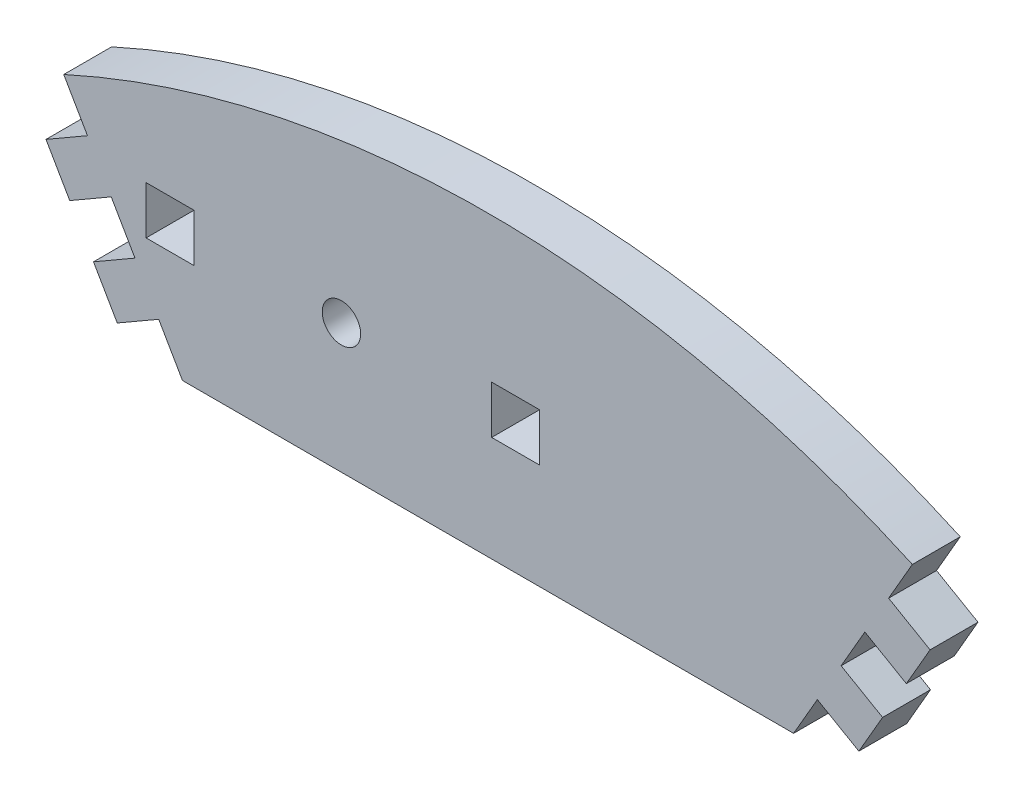
ISO-10303-21;
HEADER;
FILE_DESCRIPTION(('STEP AP214'),'2;1');
FILE_NAME('part.step','',(''),(''),'','','');
FILE_SCHEMA(('AUTOMOTIVE_DESIGN { 1 0 10303 214 1 1 1 1 }'));
ENDSEC;
DATA;
#1=APPLICATION_CONTEXT('core data for automotive mechanical design processes');
#2=APPLICATION_PROTOCOL_DEFINITION('international standard','automotive_design',2000,#1);
#3=PRODUCT_CONTEXT('',#1,'mechanical');
#4=PRODUCT('Part','Part','',(#3));
#5=PRODUCT_RELATED_PRODUCT_CATEGORY('part','',(#4));
#6=PRODUCT_DEFINITION_FORMATION('','',#4);
#7=PRODUCT_DEFINITION_CONTEXT('part definition',#1,'design');
#8=PRODUCT_DEFINITION('design','',#6,#7);
#9=PRODUCT_DEFINITION_SHAPE('','',#8);
#10=(LENGTH_UNIT() NAMED_UNIT(*) SI_UNIT(.MILLI.,.METRE.));
#11=(NAMED_UNIT(*) PLANE_ANGLE_UNIT() SI_UNIT($,.RADIAN.));
#12=(NAMED_UNIT(*) SI_UNIT($,.STERADIAN.) SOLID_ANGLE_UNIT());
#13=UNCERTAINTY_MEASURE_WITH_UNIT(LENGTH_MEASURE(1.E-05),#10,'distance_accuracy_value','');
#14=(GEOMETRIC_REPRESENTATION_CONTEXT(3) GLOBAL_UNCERTAINTY_ASSIGNED_CONTEXT((#13)) GLOBAL_UNIT_ASSIGNED_CONTEXT((#10,
#11,#12)) REPRESENTATION_CONTEXT('',''));
#15=CARTESIAN_POINT('',(0.,0.,0.));
#16=DIRECTION('',(0.,0.,1.));
#17=DIRECTION('',(1.,0.,0.));
#18=AXIS2_PLACEMENT_3D('',#15,#16,#17);
#19=CARTESIAN_POINT('',(-35.403,82.4086096476236,5.15));
#20=DIRECTION('',(-0.5,0.866025403784439,0.));
#21=DIRECTION('',(-0.866025403784439,-0.5,0.));
#22=AXIS2_PLACEMENT_3D('',#19,#20,#21);
#23=PLANE('',#22);
#24=DIRECTION('',(0.866025403784439,0.5,0.));
#25=VECTOR('',#24,1.);
#26=CARTESIAN_POINT('',(-35.403,82.4086096476236,0.));
#27=LINE('',#26,#25);
#28=CARTESIAN_POINT('',(-39.8630308294899,79.8336096476236,0.));
#29=VERTEX_POINT('',#28);
#30=CARTESIAN_POINT('',(-35.403,82.4086096476236,0.));
#31=VERTEX_POINT('',#30);
#32=EDGE_CURVE('E283',#29,#31,#27,.T.);
#33=ORIENTED_EDGE('',*,*,#32,.T.);
#34=DIRECTION('',(0.,0.,-1.));
#35=VECTOR('',#34,1.);
#36=CARTESIAN_POINT('',(-35.403,82.4086096476236,5.15));
#37=LINE('',#36,#35);
#38=CARTESIAN_POINT('',(-35.403,82.4086096476236,5.15));
#39=VERTEX_POINT('',#38);
#40=EDGE_CURVE('E11',#39,#31,#37,.T.);
#41=ORIENTED_EDGE('',*,*,#40,.F.);
#42=DIRECTION('',(0.866025403784439,0.5,0.));
#43=VECTOR('',#42,1.);
#44=CARTESIAN_POINT('',(-35.403,82.4086096476236,5.15));
#45=LINE('',#44,#43);
#46=CARTESIAN_POINT('',(-39.8630308294899,79.8336096476236,5.15));
#47=VERTEX_POINT('',#46);
#48=EDGE_CURVE('E290',#47,#39,#45,.T.);
#49=ORIENTED_EDGE('',*,*,#48,.F.);
#50=DIRECTION('',(0.,0.,-1.));
#51=VECTOR('',#50,1.);
#52=CARTESIAN_POINT('',(-39.8630308294899,79.8336096476236,5.15));
#53=LINE('',#52,#51);
#54=EDGE_CURVE('E332',#47,#29,#53,.T.);
#55=ORIENTED_EDGE('',*,*,#54,.T.);
#56=EDGE_LOOP('',(#33,#41,#49,#55));
#57=FACE_BOUND('',#56,.T.);
#58=ADVANCED_FACE('F33',(#57),#23,.F.);
#59=CARTESIAN_POINT('',(-32.85,77.9866839359003,5.15));
#60=DIRECTION('',(0.866025403784441,0.499999999999996,0.));
#61=DIRECTION('',(-0.499999999999996,0.866025403784441,0.));
#62=AXIS2_PLACEMENT_3D('',#59,#60,#61);
#63=PLANE('',#62);
#64=DIRECTION('',(0.499999999999996,-0.866025403784441,0.));
#65=VECTOR('',#64,1.);
#66=CARTESIAN_POINT('',(-32.85,77.9866839359003,0.));
#67=LINE('',#66,#65);
#68=CARTESIAN_POINT('',(-32.85,77.9866839359003,0.));
#69=VERTEX_POINT('',#68);
#70=EDGE_CURVE('E335',#31,#69,#67,.T.);
#71=ORIENTED_EDGE('',*,*,#70,.T.);
#72=DIRECTION('',(0.,0.,-1.));
#73=VECTOR('',#72,1.);
#74=CARTESIAN_POINT('',(-32.85,77.9866839359003,5.15));
#75=LINE('',#74,#73);
#76=CARTESIAN_POINT('',(-32.85,77.9866839359003,5.15));
#77=VERTEX_POINT('',#76);
#78=EDGE_CURVE('E40',#77,#69,#75,.T.);
#79=ORIENTED_EDGE('',*,*,#78,.F.);
#80=DIRECTION('',(0.499999999999996,-0.866025403784441,0.));
#81=VECTOR('',#80,1.);
#82=CARTESIAN_POINT('',(-32.85,77.9866839359003,5.15));
#83=LINE('',#82,#81);
#84=EDGE_CURVE('E293',#39,#77,#83,.T.);
#85=ORIENTED_EDGE('',*,*,#84,.F.);
#86=ORIENTED_EDGE('',*,*,#40,.T.);
#87=EDGE_LOOP('',(#71,#79,#85,#86));
#88=FACE_BOUND('',#87,.T.);
#89=ADVANCED_FACE('F451',(#88),#63,.F.);
#90=CARTESIAN_POINT('',(-32.85,77.9866839359003,5.15));
#91=DIRECTION('',(0.,1.,0.));
#92=DIRECTION('',(-1.,0.,0.));
#93=AXIS2_PLACEMENT_3D('',#90,#91,#92);
#94=PLANE('',#93);
#95=DIRECTION('',(1.,0.,0.));
#96=VECTOR('',#95,1.);
#97=CARTESIAN_POINT('',(-32.85,77.9866839359003,0.));
#98=LINE('',#97,#96);
#99=CARTESIAN_POINT('',(32.85,77.9866839359003,0.));
#100=VERTEX_POINT('',#99);
#101=EDGE_CURVE('E337',#69,#100,#98,.T.);
#102=ORIENTED_EDGE('',*,*,#101,.T.);
#103=DIRECTION('',(0.,0.,-1.));
#104=VECTOR('',#103,1.);
#105=CARTESIAN_POINT('',(32.85,77.9866839359003,5.15));
#106=LINE('',#105,#104);
#107=CARTESIAN_POINT('',(32.85,77.9866839359003,5.15));
#108=VERTEX_POINT('',#107);
#109=EDGE_CURVE('E422',#108,#100,#106,.T.);
#110=ORIENTED_EDGE('',*,*,#109,.F.);
#111=DIRECTION('',(1.,0.,0.));
#112=VECTOR('',#111,1.);
#113=CARTESIAN_POINT('',(-32.85,77.9866839359003,5.15));
#114=LINE('',#113,#112);
#115=EDGE_CURVE('E296',#77,#108,#114,.T.);
#116=ORIENTED_EDGE('',*,*,#115,.F.);
#117=ORIENTED_EDGE('',*,*,#78,.T.);
#118=EDGE_LOOP('',(#102,#110,#116,#117));
#119=FACE_BOUND('',#118,.T.);
#120=ADVANCED_FACE('F429',(#119),#94,.F.);
#121=CARTESIAN_POINT('',(32.85,77.9866839359003,5.15));
#122=DIRECTION('',(-0.86602540378444,0.499999999999997,0.));
#123=DIRECTION('',(-0.499999999999997,-0.86602540378444,0.));
#124=AXIS2_PLACEMENT_3D('',#121,#122,#123);
#125=PLANE('',#124);
#126=DIRECTION('',(0.499999999999997,0.86602540378444,0.));
#127=VECTOR('',#126,1.);
#128=CARTESIAN_POINT('',(32.85,77.9866839359003,0.));
#129=LINE('',#128,#127);
#130=CARTESIAN_POINT('',(35.403,82.4086096476236,0.));
#131=VERTEX_POINT('',#130);
#132=EDGE_CURVE('E339',#100,#131,#129,.T.);
#133=ORIENTED_EDGE('',*,*,#132,.T.);
#134=DIRECTION('',(0.,0.,-1.));
#135=VECTOR('',#134,1.);
#136=CARTESIAN_POINT('',(35.403,82.4086096476236,5.15));
#137=LINE('',#136,#135);
#138=CARTESIAN_POINT('',(35.403,82.4086096476236,5.15));
#139=VERTEX_POINT('',#138);
#140=EDGE_CURVE('E419',#139,#131,#137,.T.);
#141=ORIENTED_EDGE('',*,*,#140,.F.);
#142=DIRECTION('',(0.499999999999997,0.86602540378444,0.));
#143=VECTOR('',#142,1.);
#144=CARTESIAN_POINT('',(32.85,77.9866839359003,5.15));
#145=LINE('',#144,#143);
#146=EDGE_CURVE('E298',#108,#139,#145,.T.);
#147=ORIENTED_EDGE('',*,*,#146,.F.);
#148=ORIENTED_EDGE('',*,*,#109,.T.);
#149=EDGE_LOOP('',(#133,#141,#147,#148));
#150=FACE_BOUND('',#149,.T.);
#151=ADVANCED_FACE('F439',(#150),#125,.F.);
#152=CARTESIAN_POINT('',(35.403,82.4086096476236,5.15));
#153=DIRECTION('',(0.5,0.866025403784439,0.));
#154=DIRECTION('',(-0.866025403784439,0.5,0.));
#155=AXIS2_PLACEMENT_3D('',#152,#153,#154);
#156=PLANE('',#155);
#157=DIRECTION('',(0.866025403784439,-0.5,0.));
#158=VECTOR('',#157,1.);
#159=CARTESIAN_POINT('',(35.403,82.4086096476236,0.));
#160=LINE('',#159,#158);
#161=CARTESIAN_POINT('',(39.8630308294899,79.8336096476236,0.));
#162=VERTEX_POINT('',#161);
#163=EDGE_CURVE('E341',#131,#162,#160,.T.);
#164=ORIENTED_EDGE('',*,*,#163,.T.);
#165=DIRECTION('',(0.,0.,-1.));
#166=VECTOR('',#165,1.);
#167=CARTESIAN_POINT('',(39.8630308294899,79.8336096476236,5.15));
#168=LINE('',#167,#166);
#169=CARTESIAN_POINT('',(39.8630308294899,79.8336096476236,5.15));
#170=VERTEX_POINT('',#169);
#171=EDGE_CURVE('E416',#170,#162,#168,.T.);
#172=ORIENTED_EDGE('',*,*,#171,.F.);
#173=DIRECTION('',(0.866025403784439,-0.5,0.));
#174=VECTOR('',#173,1.);
#175=CARTESIAN_POINT('',(35.403,82.4086096476236,5.15));
#176=LINE('',#175,#174);
#177=EDGE_CURVE('E300',#139,#170,#176,.T.);
#178=ORIENTED_EDGE('',*,*,#177,.F.);
#179=ORIENTED_EDGE('',*,*,#140,.T.);
#180=EDGE_LOOP('',(#164,#172,#178,#179));
#181=FACE_BOUND('',#180,.T.);
#182=ADVANCED_FACE('F443',(#181),#156,.F.);
#183=CARTESIAN_POINT('',(39.8630308294899,79.8336096476236,5.15));
#184=DIRECTION('',(-0.866025403784439,0.499999999999999,0.));
#185=DIRECTION('',(-0.499999999999999,-0.866025403784439,0.));
#186=AXIS2_PLACEMENT_3D('',#183,#184,#185);
#187=PLANE('',#186);
#188=DIRECTION('',(0.499999999999999,0.866025403784439,0.));
#189=VECTOR('',#188,1.);
#190=CARTESIAN_POINT('',(39.8630308294899,79.8336096476236,0.));
#191=LINE('',#190,#189);
#192=CARTESIAN_POINT('',(42.4160308294899,84.255535359347,0.));
#193=VERTEX_POINT('',#192);
#194=EDGE_CURVE('E343',#162,#193,#191,.T.);
#195=ORIENTED_EDGE('',*,*,#194,.T.);
#196=DIRECTION('',(0.,0.,-1.));
#197=VECTOR('',#196,1.);
#198=CARTESIAN_POINT('',(42.4160308294899,84.255535359347,5.15));
#199=LINE('',#198,#197);
#200=CARTESIAN_POINT('',(42.4160308294899,84.255535359347,5.15));
#201=VERTEX_POINT('',#200);
#202=EDGE_CURVE('E413',#201,#193,#199,.T.);
#203=ORIENTED_EDGE('',*,*,#202,.F.);
#204=DIRECTION('',(0.499999999999999,0.866025403784439,0.));
#205=VECTOR('',#204,1.);
#206=CARTESIAN_POINT('',(39.8630308294899,79.8336096476236,5.15));
#207=LINE('',#206,#205);
#208=EDGE_CURVE('E302',#170,#201,#207,.T.);
#209=ORIENTED_EDGE('',*,*,#208,.F.);
#210=ORIENTED_EDGE('',*,*,#171,.T.);
#211=EDGE_LOOP('',(#195,#203,#209,#210));
#212=FACE_BOUND('',#211,.T.);
#213=ADVANCED_FACE('F524',(#212),#187,.F.);
#214=CARTESIAN_POINT('',(42.4160308294899,84.255535359347,5.15));
#215=DIRECTION('',(-0.499999999999998,-0.86602540378444,0.));
#216=DIRECTION('',(0.86602540378444,-0.499999999999998,0.));
#217=AXIS2_PLACEMENT_3D('',#214,#215,#216);
#218=PLANE('',#217);
#219=DIRECTION('',(-0.86602540378444,0.499999999999998,0.));
#220=VECTOR('',#219,1.);
#221=CARTESIAN_POINT('',(42.4160308294899,84.255535359347,0.));
#222=LINE('',#221,#220);
#223=CARTESIAN_POINT('',(37.956,86.830535359347,0.));
#224=VERTEX_POINT('',#223);
#225=EDGE_CURVE('E345',#193,#224,#222,.T.);
#226=ORIENTED_EDGE('',*,*,#225,.T.);
#227=DIRECTION('',(0.,0.,-1.));
#228=VECTOR('',#227,1.);
#229=CARTESIAN_POINT('',(37.956,86.830535359347,5.15));
#230=LINE('',#229,#228);
#231=CARTESIAN_POINT('',(37.956,86.830535359347,5.15));
#232=VERTEX_POINT('',#231);
#233=EDGE_CURVE('E410',#232,#224,#230,.T.);
#234=ORIENTED_EDGE('',*,*,#233,.F.);
#235=DIRECTION('',(-0.86602540378444,0.499999999999998,0.));
#236=VECTOR('',#235,1.);
#237=CARTESIAN_POINT('',(42.4160308294899,84.255535359347,5.15));
#238=LINE('',#237,#236);
#239=EDGE_CURVE('E304',#201,#232,#238,.T.);
#240=ORIENTED_EDGE('',*,*,#239,.F.);
#241=ORIENTED_EDGE('',*,*,#202,.T.);
#242=EDGE_LOOP('',(#226,#234,#240,#241));
#243=FACE_BOUND('',#242,.T.);
#244=ADVANCED_FACE('F522',(#243),#218,.F.);
#245=CARTESIAN_POINT('',(37.956,86.830535359347,5.15));
#246=DIRECTION('',(-0.86602540378444,0.499999999999998,0.));
#247=DIRECTION('',(-0.499999999999998,-0.86602540378444,0.));
#248=AXIS2_PLACEMENT_3D('',#245,#246,#247);
#249=PLANE('',#248);
#250=DIRECTION('',(0.499999999999998,0.86602540378444,0.));
#251=VECTOR('',#250,1.);
#252=CARTESIAN_POINT('',(37.956,86.830535359347,0.));
#253=LINE('',#252,#251);
#254=CARTESIAN_POINT('',(40.509,91.2524610710703,0.));
#255=VERTEX_POINT('',#254);
#256=EDGE_CURVE('E347',#224,#255,#253,.T.);
#257=ORIENTED_EDGE('',*,*,#256,.T.);
#258=DIRECTION('',(0.,0.,-1.));
#259=VECTOR('',#258,1.);
#260=CARTESIAN_POINT('',(40.509,91.2524610710703,5.15));
#261=LINE('',#260,#259);
#262=CARTESIAN_POINT('',(40.509,91.2524610710703,5.15));
#263=VERTEX_POINT('',#262);
#264=EDGE_CURVE('E407',#263,#255,#261,.T.);
#265=ORIENTED_EDGE('',*,*,#264,.F.);
#266=DIRECTION('',(0.499999999999998,0.86602540378444,0.));
#267=VECTOR('',#266,1.);
#268=CARTESIAN_POINT('',(37.956,86.830535359347,5.15));
#269=LINE('',#268,#267);
#270=EDGE_CURVE('E306',#232,#263,#269,.T.);
#271=ORIENTED_EDGE('',*,*,#270,.F.);
#272=ORIENTED_EDGE('',*,*,#233,.T.);
#273=EDGE_LOOP('',(#257,#265,#271,#272));
#274=FACE_BOUND('',#273,.T.);
#275=ADVANCED_FACE('F517',(#274),#249,.F.);
#276=CARTESIAN_POINT('',(40.509,91.2524610710703,5.15));
#277=DIRECTION('',(0.499999999999998,0.86602540378444,0.));
#278=DIRECTION('',(-0.86602540378444,0.499999999999998,0.));
#279=AXIS2_PLACEMENT_3D('',#276,#277,#278);
#280=PLANE('',#279);
#281=DIRECTION('',(0.86602540378444,-0.499999999999998,0.));
#282=VECTOR('',#281,1.);
#283=CARTESIAN_POINT('',(40.509,91.2524610710703,0.));
#284=LINE('',#283,#282);
#285=CARTESIAN_POINT('',(44.9690308294899,88.6774610710703,0.));
#286=VERTEX_POINT('',#285);
#287=EDGE_CURVE('E349',#255,#286,#284,.T.);
#288=ORIENTED_EDGE('',*,*,#287,.T.);
#289=DIRECTION('',(0.,0.,-1.));
#290=VECTOR('',#289,1.);
#291=CARTESIAN_POINT('',(44.9690308294899,88.6774610710703,5.15));
#292=LINE('',#291,#290);
#293=CARTESIAN_POINT('',(44.9690308294899,88.6774610710703,5.15));
#294=VERTEX_POINT('',#293);
#295=EDGE_CURVE('E404',#294,#286,#292,.T.);
#296=ORIENTED_EDGE('',*,*,#295,.F.);
#297=DIRECTION('',(0.86602540378444,-0.499999999999998,0.));
#298=VECTOR('',#297,1.);
#299=CARTESIAN_POINT('',(40.509,91.2524610710703,5.15));
#300=LINE('',#299,#298);
#301=EDGE_CURVE('E308',#263,#294,#300,.T.);
#302=ORIENTED_EDGE('',*,*,#301,.F.);
#303=ORIENTED_EDGE('',*,*,#264,.T.);
#304=EDGE_LOOP('',(#288,#296,#302,#303));
#305=FACE_BOUND('',#304,.T.);
#306=ADVANCED_FACE('F512',(#305),#280,.F.);
#307=CARTESIAN_POINT('',(44.9690308294899,88.6774610710703,5.15));
#308=DIRECTION('',(-0.866025403784441,0.499999999999995,0.));
#309=DIRECTION('',(-0.499999999999995,-0.866025403784441,0.));
#310=AXIS2_PLACEMENT_3D('',#307,#308,#309);
#311=PLANE('',#310);
#312=DIRECTION('',(0.499999999999995,0.866025403784441,0.));
#313=VECTOR('',#312,1.);
#314=CARTESIAN_POINT('',(44.9690308294899,88.6774610710703,0.));
#315=LINE('',#314,#313);
#316=CARTESIAN_POINT('',(47.5220308294898,93.0993867827937,0.));
#317=VERTEX_POINT('',#316);
#318=EDGE_CURVE('E351',#286,#317,#315,.T.);
#319=ORIENTED_EDGE('',*,*,#318,.T.);
#320=DIRECTION('',(0.,0.,-1.));
#321=VECTOR('',#320,1.);
#322=CARTESIAN_POINT('',(47.5220308294898,93.0993867827937,5.15));
#323=LINE('',#322,#321);
#324=CARTESIAN_POINT('',(47.5220308294898,93.0993867827937,5.15));
#325=VERTEX_POINT('',#324);
#326=EDGE_CURVE('E401',#325,#317,#323,.T.);
#327=ORIENTED_EDGE('',*,*,#326,.F.);
#328=DIRECTION('',(0.499999999999995,0.866025403784441,0.));
#329=VECTOR('',#328,1.);
#330=CARTESIAN_POINT('',(44.9690308294899,88.6774610710703,5.15));
#331=LINE('',#330,#329);
#332=EDGE_CURVE('E310',#294,#325,#331,.T.);
#333=ORIENTED_EDGE('',*,*,#332,.F.);
#334=ORIENTED_EDGE('',*,*,#295,.T.);
#335=EDGE_LOOP('',(#319,#327,#333,#334));
#336=FACE_BOUND('',#335,.T.);
#337=ADVANCED_FACE('F508',(#336),#311,.F.);
#338=CARTESIAN_POINT('',(47.5220308294898,93.0993867827937,5.15));
#339=DIRECTION('',(-0.500000000000002,-0.866025403784437,0.));
#340=DIRECTION('',(0.866025403784438,-0.500000000000002,0.));
#341=AXIS2_PLACEMENT_3D('',#338,#339,#340);
#342=PLANE('',#341);
#343=DIRECTION('',(-0.866025403784437,0.500000000000002,0.));
#344=VECTOR('',#343,1.);
#345=CARTESIAN_POINT('',(47.5220308294898,93.0993867827937,0.));
#346=LINE('',#345,#344);
#347=CARTESIAN_POINT('',(43.062,95.6743867827937,0.));
#348=VERTEX_POINT('',#347);
#349=EDGE_CURVE('E353',#317,#348,#346,.T.);
#350=ORIENTED_EDGE('',*,*,#349,.T.);
#351=DIRECTION('',(0.,0.,-1.));
#352=VECTOR('',#351,1.);
#353=CARTESIAN_POINT('',(43.062,95.6743867827937,5.15));
#354=LINE('',#353,#352);
#355=CARTESIAN_POINT('',(43.062,95.6743867827937,5.15));
#356=VERTEX_POINT('',#355);
#357=EDGE_CURVE('E398',#356,#348,#354,.T.);
#358=ORIENTED_EDGE('',*,*,#357,.F.);
#359=DIRECTION('',(-0.866025403784437,0.500000000000002,0.));
#360=VECTOR('',#359,1.);
#361=CARTESIAN_POINT('',(47.5220308294898,93.0993867827937,5.15));
#362=LINE('',#361,#360);
#363=EDGE_CURVE('E312',#325,#356,#362,.T.);
#364=ORIENTED_EDGE('',*,*,#363,.F.);
#365=ORIENTED_EDGE('',*,*,#326,.T.);
#366=EDGE_LOOP('',(#350,#358,#364,#365));
#367=FACE_BOUND('',#366,.T.);
#368=ADVANCED_FACE('F503',(#367),#342,.F.);
#369=CARTESIAN_POINT('',(43.062,95.6743867827937,5.15));
#370=DIRECTION('',(-0.866025403784439,0.499999999999999,0.));
#371=DIRECTION('',(-0.499999999999999,-0.866025403784439,0.));
#372=AXIS2_PLACEMENT_3D('',#369,#370,#371);
#373=PLANE('',#372);
#374=DIRECTION('',(0.499999999999999,0.866025403784439,0.));
#375=VECTOR('',#374,1.);
#376=CARTESIAN_POINT('',(43.062,95.6743867827937,0.));
#377=LINE('',#376,#375);
#378=CARTESIAN_POINT('',(45.615,100.096312494517,0.));
#379=VERTEX_POINT('',#378);
#380=EDGE_CURVE('E355',#348,#379,#377,.T.);
#381=ORIENTED_EDGE('',*,*,#380,.T.);
#382=DIRECTION('',(0.,0.,-1.));
#383=VECTOR('',#382,1.);
#384=CARTESIAN_POINT('',(45.615,100.096312494517,5.15));
#385=LINE('',#384,#383);
#386=CARTESIAN_POINT('',(45.615,100.096312494517,5.15));
#387=VERTEX_POINT('',#386);
#388=EDGE_CURVE('E395',#387,#379,#385,.T.);
#389=ORIENTED_EDGE('',*,*,#388,.F.);
#390=DIRECTION('',(0.499999999999999,0.866025403784439,0.));
#391=VECTOR('',#390,1.);
#392=CARTESIAN_POINT('',(43.062,95.6743867827937,5.15));
#393=LINE('',#392,#391);
#394=EDGE_CURVE('E314',#356,#387,#393,.T.);
#395=ORIENTED_EDGE('',*,*,#394,.F.);
#396=ORIENTED_EDGE('',*,*,#357,.T.);
#397=EDGE_LOOP('',(#381,#389,#395,#396));
#398=FACE_BOUND('',#397,.T.);
#399=ADVANCED_FACE('F497',(#398),#373,.F.);
#400=CARTESIAN_POINT('',(0.,0.,5.15));
#401=DIRECTION('',(0.,0.,-1.));
#402=DIRECTION('',(-1.,0.,0.));
#403=AXIS2_PLACEMENT_3D('',#400,#401,#402);
#404=CYLINDRICAL_SURFACE('',#403,110.);
#405=CARTESIAN_POINT('',(0.,0.,0.));
#406=DIRECTION('',(0.,0.,1.));
#407=DIRECTION('',(-1.,0.,0.));
#408=AXIS2_PLACEMENT_3D('',#405,#406,#407);
#409=CIRCLE('',#408,110.);
#410=CARTESIAN_POINT('',(-45.615,100.096312494517,0.));
#411=VERTEX_POINT('',#410);
#412=EDGE_CURVE('E357',#379,#411,#409,.T.);
#413=ORIENTED_EDGE('',*,*,#412,.T.);
#414=DIRECTION('',(0.,0.,-1.));
#415=VECTOR('',#414,1.);
#416=CARTESIAN_POINT('',(-45.615,100.096312494517,5.15));
#417=LINE('',#416,#415);
#418=CARTESIAN_POINT('',(-45.615,100.096312494517,5.15));
#419=VERTEX_POINT('',#418);
#420=EDGE_CURVE('E392',#419,#411,#417,.T.);
#421=ORIENTED_EDGE('',*,*,#420,.F.);
#422=CARTESIAN_POINT('',(0.,0.,5.15));
#423=DIRECTION('',(0.,0.,1.));
#424=DIRECTION('',(-1.,0.,0.));
#425=AXIS2_PLACEMENT_3D('',#422,#423,#424);
#426=CIRCLE('',#425,110.);
#427=EDGE_CURVE('E316',#387,#419,#426,.T.);
#428=ORIENTED_EDGE('',*,*,#427,.F.);
#429=ORIENTED_EDGE('',*,*,#388,.T.);
#430=EDGE_LOOP('',(#413,#421,#428,#429));
#431=FACE_BOUND('',#430,.T.);
#432=ADVANCED_FACE('F493',(#431),#404,.T.);
#433=CARTESIAN_POINT('',(-43.062,95.6743867827937,5.15));
#434=DIRECTION('',(0.866025403784439,0.499999999999999,0.));
#435=DIRECTION('',(-0.499999999999999,0.866025403784439,0.));
#436=AXIS2_PLACEMENT_3D('',#433,#434,#435);
#437=PLANE('',#436);
#438=DIRECTION('',(0.499999999999999,-0.866025403784439,0.));
#439=VECTOR('',#438,1.);
#440=CARTESIAN_POINT('',(-43.062,95.6743867827937,0.));
#441=LINE('',#440,#439);
#442=CARTESIAN_POINT('',(-43.062,95.6743867827937,0.));
#443=VERTEX_POINT('',#442);
#444=EDGE_CURVE('E359',#411,#443,#441,.T.);
#445=ORIENTED_EDGE('',*,*,#444,.T.);
#446=DIRECTION('',(0.,0.,-1.));
#447=VECTOR('',#446,1.);
#448=CARTESIAN_POINT('',(-43.062,95.6743867827937,5.15));
#449=LINE('',#448,#447);
#450=CARTESIAN_POINT('',(-43.062,95.6743867827937,5.15));
#451=VERTEX_POINT('',#450);
#452=EDGE_CURVE('E389',#451,#443,#449,.T.);
#453=ORIENTED_EDGE('',*,*,#452,.F.);
#454=DIRECTION('',(0.499999999999999,-0.866025403784439,0.));
#455=VECTOR('',#454,1.);
#456=CARTESIAN_POINT('',(-43.062,95.6743867827937,5.15));
#457=LINE('',#456,#455);
#458=EDGE_CURVE('E318',#419,#451,#457,.T.);
#459=ORIENTED_EDGE('',*,*,#458,.F.);
#460=ORIENTED_EDGE('',*,*,#420,.T.);
#461=EDGE_LOOP('',(#445,#453,#459,#460));
#462=FACE_BOUND('',#461,.T.);
#463=ADVANCED_FACE('F488',(#462),#437,.F.);
#464=CARTESIAN_POINT('',(-47.5220308294898,93.0993867827937,5.15));
#465=DIRECTION('',(0.500000000000002,-0.866025403784437,0.));
#466=DIRECTION('',(0.866025403784438,0.500000000000002,0.));
#467=AXIS2_PLACEMENT_3D('',#464,#465,#466);
#468=PLANE('',#467);
#469=DIRECTION('',(-0.866025403784437,-0.500000000000002,0.));
#470=VECTOR('',#469,1.);
#471=CARTESIAN_POINT('',(-47.5220308294898,93.0993867827937,0.));
#472=LINE('',#471,#470);
#473=CARTESIAN_POINT('',(-47.5220308294898,93.0993867827937,0.));
#474=VERTEX_POINT('',#473);
#475=EDGE_CURVE('E361',#443,#474,#472,.T.);
#476=ORIENTED_EDGE('',*,*,#475,.T.);
#477=DIRECTION('',(0.,0.,-1.));
#478=VECTOR('',#477,1.);
#479=CARTESIAN_POINT('',(-47.5220308294898,93.0993867827937,5.15));
#480=LINE('',#479,#478);
#481=CARTESIAN_POINT('',(-47.5220308294898,93.0993867827937,5.15));
#482=VERTEX_POINT('',#481);
#483=EDGE_CURVE('E386',#482,#474,#480,.T.);
#484=ORIENTED_EDGE('',*,*,#483,.F.);
#485=DIRECTION('',(-0.866025403784437,-0.500000000000002,0.));
#486=VECTOR('',#485,1.);
#487=CARTESIAN_POINT('',(-47.5220308294898,93.0993867827937,5.15));
#488=LINE('',#487,#486);
#489=EDGE_CURVE('E320',#451,#482,#488,.T.);
#490=ORIENTED_EDGE('',*,*,#489,.F.);
#491=ORIENTED_EDGE('',*,*,#452,.T.);
#492=EDGE_LOOP('',(#476,#484,#490,#491));
#493=FACE_BOUND('',#492,.T.);
#494=ADVANCED_FACE('F482',(#493),#468,.F.);
#495=CARTESIAN_POINT('',(-44.9690308294899,88.6774610710703,5.15));
#496=DIRECTION('',(0.866025403784441,0.499999999999995,0.));
#497=DIRECTION('',(-0.499999999999995,0.866025403784441,0.));
#498=AXIS2_PLACEMENT_3D('',#495,#496,#497);
#499=PLANE('',#498);
#500=DIRECTION('',(0.499999999999995,-0.866025403784441,0.));
#501=VECTOR('',#500,1.);
#502=CARTESIAN_POINT('',(-44.9690308294899,88.6774610710703,0.));
#503=LINE('',#502,#501);
#504=CARTESIAN_POINT('',(-44.9690308294899,88.6774610710703,0.));
#505=VERTEX_POINT('',#504);
#506=EDGE_CURVE('E363',#474,#505,#503,.T.);
#507=ORIENTED_EDGE('',*,*,#506,.T.);
#508=DIRECTION('',(0.,0.,-1.));
#509=VECTOR('',#508,1.);
#510=CARTESIAN_POINT('',(-44.9690308294899,88.6774610710703,5.15));
#511=LINE('',#510,#509);
#512=CARTESIAN_POINT('',(-44.9690308294899,88.6774610710703,5.15));
#513=VERTEX_POINT('',#512);
#514=EDGE_CURVE('E383',#513,#505,#511,.T.);
#515=ORIENTED_EDGE('',*,*,#514,.F.);
#516=DIRECTION('',(0.499999999999995,-0.866025403784441,0.));
#517=VECTOR('',#516,1.);
#518=CARTESIAN_POINT('',(-44.9690308294899,88.6774610710703,5.15));
#519=LINE('',#518,#517);
#520=EDGE_CURVE('E322',#482,#513,#519,.T.);
#521=ORIENTED_EDGE('',*,*,#520,.F.);
#522=ORIENTED_EDGE('',*,*,#483,.T.);
#523=EDGE_LOOP('',(#507,#515,#521,#522));
#524=FACE_BOUND('',#523,.T.);
#525=ADVANCED_FACE('F478',(#524),#499,.F.);
#526=CARTESIAN_POINT('',(-40.509,91.2524610710703,5.15));
#527=DIRECTION('',(-0.499999999999998,0.86602540378444,0.));
#528=DIRECTION('',(-0.86602540378444,-0.499999999999998,0.));
#529=AXIS2_PLACEMENT_3D('',#526,#527,#528);
#530=PLANE('',#529);
#531=DIRECTION('',(0.86602540378444,0.499999999999998,0.));
#532=VECTOR('',#531,1.);
#533=CARTESIAN_POINT('',(-40.509,91.2524610710703,0.));
#534=LINE('',#533,#532);
#535=CARTESIAN_POINT('',(-40.509,91.2524610710703,0.));
#536=VERTEX_POINT('',#535);
#537=EDGE_CURVE('E365',#505,#536,#534,.T.);
#538=ORIENTED_EDGE('',*,*,#537,.T.);
#539=DIRECTION('',(0.,0.,-1.));
#540=VECTOR('',#539,1.);
#541=CARTESIAN_POINT('',(-40.509,91.2524610710703,5.15));
#542=LINE('',#541,#540);
#543=CARTESIAN_POINT('',(-40.509,91.2524610710703,5.15));
#544=VERTEX_POINT('',#543);
#545=EDGE_CURVE('E380',#544,#536,#542,.T.);
#546=ORIENTED_EDGE('',*,*,#545,.F.);
#547=DIRECTION('',(0.86602540378444,0.499999999999998,0.));
#548=VECTOR('',#547,1.);
#549=CARTESIAN_POINT('',(-40.509,91.2524610710703,5.15));
#550=LINE('',#549,#548);
#551=EDGE_CURVE('E324',#513,#544,#550,.T.);
#552=ORIENTED_EDGE('',*,*,#551,.F.);
#553=ORIENTED_EDGE('',*,*,#514,.T.);
#554=EDGE_LOOP('',(#538,#546,#552,#553));
#555=FACE_BOUND('',#554,.T.);
#556=ADVANCED_FACE('F473',(#555),#530,.F.);
#557=CARTESIAN_POINT('',(-37.956,86.830535359347,5.15));
#558=DIRECTION('',(0.86602540378444,0.499999999999998,0.));
#559=DIRECTION('',(-0.499999999999998,0.86602540378444,0.));
#560=AXIS2_PLACEMENT_3D('',#557,#558,#559);
#561=PLANE('',#560);
#562=DIRECTION('',(0.499999999999998,-0.86602540378444,0.));
#563=VECTOR('',#562,1.);
#564=CARTESIAN_POINT('',(-37.956,86.830535359347,0.));
#565=LINE('',#564,#563);
#566=CARTESIAN_POINT('',(-37.956,86.830535359347,0.));
#567=VERTEX_POINT('',#566);
#568=EDGE_CURVE('E367',#536,#567,#565,.T.);
#569=ORIENTED_EDGE('',*,*,#568,.T.);
#570=DIRECTION('',(0.,0.,-1.));
#571=VECTOR('',#570,1.);
#572=CARTESIAN_POINT('',(-37.956,86.830535359347,5.15));
#573=LINE('',#572,#571);
#574=CARTESIAN_POINT('',(-37.956,86.830535359347,5.15));
#575=VERTEX_POINT('',#574);
#576=EDGE_CURVE('E377',#575,#567,#573,.T.);
#577=ORIENTED_EDGE('',*,*,#576,.F.);
#578=DIRECTION('',(0.499999999999998,-0.86602540378444,0.));
#579=VECTOR('',#578,1.);
#580=CARTESIAN_POINT('',(-37.956,86.830535359347,5.15));
#581=LINE('',#580,#579);
#582=EDGE_CURVE('E326',#544,#575,#581,.T.);
#583=ORIENTED_EDGE('',*,*,#582,.F.);
#584=ORIENTED_EDGE('',*,*,#545,.T.);
#585=EDGE_LOOP('',(#569,#577,#583,#584));
#586=FACE_BOUND('',#585,.T.);
#587=ADVANCED_FACE('F467',(#586),#561,.F.);
#588=CARTESIAN_POINT('',(-42.4160308294899,84.255535359347,5.15));
#589=DIRECTION('',(0.499999999999998,-0.86602540378444,0.));
#590=DIRECTION('',(0.86602540378444,0.499999999999998,0.));
#591=AXIS2_PLACEMENT_3D('',#588,#589,#590);
#592=PLANE('',#591);
#593=DIRECTION('',(-0.86602540378444,-0.499999999999998,0.));
#594=VECTOR('',#593,1.);
#595=CARTESIAN_POINT('',(-42.4160308294899,84.255535359347,0.));
#596=LINE('',#595,#594);
#597=CARTESIAN_POINT('',(-42.4160308294899,84.255535359347,0.));
#598=VERTEX_POINT('',#597);
#599=EDGE_CURVE('E369',#567,#598,#596,.T.);
#600=ORIENTED_EDGE('',*,*,#599,.T.);
#601=DIRECTION('',(0.,0.,-1.));
#602=VECTOR('',#601,1.);
#603=CARTESIAN_POINT('',(-42.4160308294899,84.255535359347,5.15));
#604=LINE('',#603,#602);
#605=CARTESIAN_POINT('',(-42.4160308294899,84.255535359347,5.15));
#606=VERTEX_POINT('',#605);
#607=EDGE_CURVE('E374',#606,#598,#604,.T.);
#608=ORIENTED_EDGE('',*,*,#607,.F.);
#609=DIRECTION('',(-0.86602540378444,-0.499999999999998,0.));
#610=VECTOR('',#609,1.);
#611=CARTESIAN_POINT('',(-42.4160308294899,84.255535359347,5.15));
#612=LINE('',#611,#610);
#613=EDGE_CURVE('E328',#575,#606,#612,.T.);
#614=ORIENTED_EDGE('',*,*,#613,.F.);
#615=ORIENTED_EDGE('',*,*,#576,.T.);
#616=EDGE_LOOP('',(#600,#608,#614,#615));
#617=FACE_BOUND('',#616,.T.);
#618=ADVANCED_FACE('F463',(#617),#592,.F.);
#619=CARTESIAN_POINT('',(-39.8630308294899,79.8336096476236,5.15));
#620=DIRECTION('',(0.866025403784439,0.499999999999999,0.));
#621=DIRECTION('',(-0.499999999999999,0.866025403784439,0.));
#622=AXIS2_PLACEMENT_3D('',#619,#620,#621);
#623=PLANE('',#622);
#624=DIRECTION('',(0.499999999999999,-0.866025403784439,0.));
#625=VECTOR('',#624,1.);
#626=CARTESIAN_POINT('',(-39.8630308294899,79.8336096476236,0.));
#627=LINE('',#626,#625);
#628=EDGE_CURVE('E294',#598,#29,#627,.T.);
#629=ORIENTED_EDGE('',*,*,#628,.T.);
#630=ORIENTED_EDGE('',*,*,#54,.F.);
#631=DIRECTION('',(0.499999999999999,-0.866025403784439,0.));
#632=VECTOR('',#631,1.);
#633=CARTESIAN_POINT('',(-39.8630308294899,79.8336096476236,5.15));
#634=LINE('',#633,#632);
#635=EDGE_CURVE('E330',#606,#47,#634,.T.);
#636=ORIENTED_EDGE('',*,*,#635,.F.);
#637=ORIENTED_EDGE('',*,*,#607,.T.);
#638=EDGE_LOOP('',(#629,#630,#636,#637));
#639=FACE_BOUND('',#638,.T.);
#640=ADVANCED_FACE('F458',(#639),#623,.F.);
#641=CARTESIAN_POINT('',(0.,0.,5.15));
#642=DIRECTION('',(0.,0.,-1.));
#643=DIRECTION('',(-1.,0.,0.));
#644=AXIS2_PLACEMENT_3D('',#641,#642,#643);
#645=PLANE('',#644);
#646=CARTESIAN_POINT('',(-15.76,91.8974143871666,5.15));
#647=DIRECTION('',(0.,0.,1.));
#648=DIRECTION('',(1.,0.,0.));
#649=AXIS2_PLACEMENT_3D('',#646,#647,#648);
#650=CIRCLE('',#649,2.06749999999999);
#651=CARTESIAN_POINT('',(-13.6925,91.8974143871666,5.15));
#652=VERTEX_POINT('',#651);
#653=EDGE_CURVE('E241',#652,#652,#650,.T.);
#654=ORIENTED_EDGE('',*,*,#653,.F.);
#655=EDGE_LOOP('',(#654));
#656=FACE_BOUND('',#655,.T.);
#657=DIRECTION('',(1.,0.,0.));
#658=VECTOR('',#657,1.);
#659=CARTESIAN_POINT('',(-31.61,89.3078211125544,5.15));
#660=LINE('',#659,#658);
#661=CARTESIAN_POINT('',(-36.76,89.3078211125544,5.15));
#662=VERTEX_POINT('',#661);
#663=CARTESIAN_POINT('',(-31.61,89.3078211125544,5.15));
#664=VERTEX_POINT('',#663);
#665=EDGE_CURVE('E247',#662,#664,#660,.T.);
#666=ORIENTED_EDGE('',*,*,#665,.F.);
#667=DIRECTION('',(0.,-1.,0.));
#668=VECTOR('',#667,1.);
#669=CARTESIAN_POINT('',(-36.76,89.3078211125544,5.15));
#670=LINE('',#669,#668);
#671=CARTESIAN_POINT('',(-36.76,94.4578211125545,5.15));
#672=VERTEX_POINT('',#671);
#673=EDGE_CURVE('E47',#672,#662,#670,.T.);
#674=ORIENTED_EDGE('',*,*,#673,.F.);
#675=DIRECTION('',(-1.,0.,0.));
#676=VECTOR('',#675,1.);
#677=CARTESIAN_POINT('',(-31.61,94.4578211125545,5.15));
#678=LINE('',#677,#676);
#679=CARTESIAN_POINT('',(-31.61,94.4578211125545,5.15));
#680=VERTEX_POINT('',#679);
#681=EDGE_CURVE('E235',#680,#672,#678,.T.);
#682=ORIENTED_EDGE('',*,*,#681,.F.);
#683=DIRECTION('',(0.,1.,0.));
#684=VECTOR('',#683,1.);
#685=CARTESIAN_POINT('',(-31.61,89.3078211125544,5.15));
#686=LINE('',#685,#684);
#687=EDGE_CURVE('E238',#664,#680,#686,.T.);
#688=ORIENTED_EDGE('',*,*,#687,.F.);
#689=EDGE_LOOP('',(#666,#674,#682,#688));
#690=FACE_BOUND('',#689,.T.);
#691=DIRECTION('',(1.,0.,0.));
#692=VECTOR('',#691,1.);
#693=CARTESIAN_POINT('',(0.390000000000016,89.3078211125544,5.15));
#694=LINE('',#693,#692);
#695=CARTESIAN_POINT('',(0.390000000000016,89.3078211125544,5.15));
#696=VERTEX_POINT('',#695);
#697=CARTESIAN_POINT('',(5.54000000000002,89.3078211125544,5.15));
#698=VERTEX_POINT('',#697);
#699=EDGE_CURVE('E273',#696,#698,#694,.T.);
#700=ORIENTED_EDGE('',*,*,#699,.F.);
#701=DIRECTION('',(0.,-1.,0.));
#702=VECTOR('',#701,1.);
#703=CARTESIAN_POINT('',(0.390000000000015,94.4578211125545,5.15));
#704=LINE('',#703,#702);
#705=CARTESIAN_POINT('',(0.390000000000015,94.4578211125545,5.15));
#706=VERTEX_POINT('',#705);
#707=EDGE_CURVE('E254',#706,#696,#704,.T.);
#708=ORIENTED_EDGE('',*,*,#707,.F.);
#709=DIRECTION('',(-1.,0.,0.));
#710=VECTOR('',#709,1.);
#711=CARTESIAN_POINT('',(0.390000000000015,94.4578211125545,5.15));
#712=LINE('',#711,#710);
#713=CARTESIAN_POINT('',(5.54000000000002,94.4578211125545,5.15));
#714=VERTEX_POINT('',#713);
#715=EDGE_CURVE('E262',#714,#706,#712,.T.);
#716=ORIENTED_EDGE('',*,*,#715,.F.);
#717=DIRECTION('',(0.,1.,0.));
#718=VECTOR('',#717,1.);
#719=CARTESIAN_POINT('',(5.54000000000002,94.4578211125545,5.15));
#720=LINE('',#719,#718);
#721=EDGE_CURVE('E276',#698,#714,#720,.T.);
#722=ORIENTED_EDGE('',*,*,#721,.F.);
#723=EDGE_LOOP('',(#700,#708,#716,#722));
#724=FACE_BOUND('',#723,.T.);
#725=ORIENTED_EDGE('',*,*,#48,.T.);
#726=ORIENTED_EDGE('',*,*,#84,.T.);
#727=ORIENTED_EDGE('',*,*,#115,.T.);
#728=ORIENTED_EDGE('',*,*,#146,.T.);
#729=ORIENTED_EDGE('',*,*,#177,.T.);
#730=ORIENTED_EDGE('',*,*,#208,.T.);
#731=ORIENTED_EDGE('',*,*,#239,.T.);
#732=ORIENTED_EDGE('',*,*,#270,.T.);
#733=ORIENTED_EDGE('',*,*,#301,.T.);
#734=ORIENTED_EDGE('',*,*,#332,.T.);
#735=ORIENTED_EDGE('',*,*,#363,.T.);
#736=ORIENTED_EDGE('',*,*,#394,.T.);
#737=ORIENTED_EDGE('',*,*,#427,.T.);
#738=ORIENTED_EDGE('',*,*,#458,.T.);
#739=ORIENTED_EDGE('',*,*,#489,.T.);
#740=ORIENTED_EDGE('',*,*,#520,.T.);
#741=ORIENTED_EDGE('',*,*,#551,.T.);
#742=ORIENTED_EDGE('',*,*,#582,.T.);
#743=ORIENTED_EDGE('',*,*,#613,.T.);
#744=ORIENTED_EDGE('',*,*,#635,.T.);
#745=EDGE_LOOP('',(#725,#726,#727,#728,#729,#730,#731,#732,#733,#734,#735,#736,#737,#738,#739,
#740,#741,#742,#743,#744));
#746=FACE_BOUND('',#745,.T.);
#747=ADVANCED_FACE('F447',(#656,#690,#724,#746),#645,.F.);
#748=CARTESIAN_POINT('',(0.,0.,0.));
#749=DIRECTION('',(0.,0.,-1.));
#750=DIRECTION('',(-1.,0.,0.));
#751=AXIS2_PLACEMENT_3D('',#748,#749,#750);
#752=PLANE('',#751);
#753=CARTESIAN_POINT('',(-15.76,91.8974143871666,0.));
#754=DIRECTION('',(0.,0.,1.));
#755=DIRECTION('',(1.,0.,0.));
#756=AXIS2_PLACEMENT_3D('',#753,#754,#755);
#757=CIRCLE('',#756,2.06749999999999);
#758=CARTESIAN_POINT('',(-13.6925,91.8974143871666,0.));
#759=VERTEX_POINT('',#758);
#760=EDGE_CURVE('E248',#759,#759,#757,.T.);
#761=ORIENTED_EDGE('',*,*,#760,.T.);
#762=EDGE_LOOP('',(#761));
#763=FACE_BOUND('',#762,.T.);
#764=DIRECTION('',(0.,-1.,0.));
#765=VECTOR('',#764,1.);
#766=CARTESIAN_POINT('',(-36.76,89.3078211125544,0.));
#767=LINE('',#766,#765);
#768=CARTESIAN_POINT('',(-36.76,94.4578211125545,0.));
#769=VERTEX_POINT('',#768);
#770=CARTESIAN_POINT('',(-36.76,89.3078211125544,0.));
#771=VERTEX_POINT('',#770);
#772=EDGE_CURVE('E219',#769,#771,#767,.T.);
#773=ORIENTED_EDGE('',*,*,#772,.T.);
#774=DIRECTION('',(1.,0.,0.));
#775=VECTOR('',#774,1.);
#776=CARTESIAN_POINT('',(-31.61,89.3078211125544,0.));
#777=LINE('',#776,#775);
#778=CARTESIAN_POINT('',(-31.61,89.3078211125544,0.));
#779=VERTEX_POINT('',#778);
#780=EDGE_CURVE('E228',#771,#779,#777,.T.);
#781=ORIENTED_EDGE('',*,*,#780,.T.);
#782=DIRECTION('',(0.,1.,0.));
#783=VECTOR('',#782,1.);
#784=CARTESIAN_POINT('',(-31.61,89.3078211125544,0.));
#785=LINE('',#784,#783);
#786=CARTESIAN_POINT('',(-31.61,94.4578211125545,0.));
#787=VERTEX_POINT('',#786);
#788=EDGE_CURVE('E55',#779,#787,#785,.T.);
#789=ORIENTED_EDGE('',*,*,#788,.T.);
#790=DIRECTION('',(-1.,0.,0.));
#791=VECTOR('',#790,1.);
#792=CARTESIAN_POINT('',(-31.61,94.4578211125545,0.));
#793=LINE('',#792,#791);
#794=EDGE_CURVE('E225',#787,#769,#793,.T.);
#795=ORIENTED_EDGE('',*,*,#794,.T.);
#796=EDGE_LOOP('',(#773,#781,#789,#795));
#797=FACE_BOUND('',#796,.T.);
#798=DIRECTION('',(0.,-1.,0.));
#799=VECTOR('',#798,1.);
#800=CARTESIAN_POINT('',(0.390000000000015,94.4578211125545,0.));
#801=LINE('',#800,#799);
#802=CARTESIAN_POINT('',(0.390000000000015,94.4578211125545,0.));
#803=VERTEX_POINT('',#802);
#804=CARTESIAN_POINT('',(0.390000000000016,89.3078211125544,0.));
#805=VERTEX_POINT('',#804);
#806=EDGE_CURVE('E258',#803,#805,#801,.T.);
#807=ORIENTED_EDGE('',*,*,#806,.T.);
#808=DIRECTION('',(1.,0.,0.));
#809=VECTOR('',#808,1.);
#810=CARTESIAN_POINT('',(0.390000000000016,89.3078211125544,0.));
#811=LINE('',#810,#809);
#812=CARTESIAN_POINT('',(5.54000000000002,89.3078211125544,0.));
#813=VERTEX_POINT('',#812);
#814=EDGE_CURVE('E261',#805,#813,#811,.T.);
#815=ORIENTED_EDGE('',*,*,#814,.T.);
#816=DIRECTION('',(0.,1.,0.));
#817=VECTOR('',#816,1.);
#818=CARTESIAN_POINT('',(5.54000000000002,94.4578211125545,0.));
#819=LINE('',#818,#817);
#820=CARTESIAN_POINT('',(5.54000000000002,94.4578211125545,0.));
#821=VERTEX_POINT('',#820);
#822=EDGE_CURVE('E265',#813,#821,#819,.T.);
#823=ORIENTED_EDGE('',*,*,#822,.T.);
#824=DIRECTION('',(-1.,0.,0.));
#825=VECTOR('',#824,1.);
#826=CARTESIAN_POINT('',(0.390000000000015,94.4578211125545,0.));
#827=LINE('',#826,#825);
#828=EDGE_CURVE('E268',#821,#803,#827,.T.);
#829=ORIENTED_EDGE('',*,*,#828,.T.);
#830=EDGE_LOOP('',(#807,#815,#823,#829));
#831=FACE_BOUND('',#830,.T.);
#832=ORIENTED_EDGE('',*,*,#32,.F.);
#833=ORIENTED_EDGE('',*,*,#628,.F.);
#834=ORIENTED_EDGE('',*,*,#599,.F.);
#835=ORIENTED_EDGE('',*,*,#568,.F.);
#836=ORIENTED_EDGE('',*,*,#537,.F.);
#837=ORIENTED_EDGE('',*,*,#506,.F.);
#838=ORIENTED_EDGE('',*,*,#475,.F.);
#839=ORIENTED_EDGE('',*,*,#444,.F.);
#840=ORIENTED_EDGE('',*,*,#412,.F.);
#841=ORIENTED_EDGE('',*,*,#380,.F.);
#842=ORIENTED_EDGE('',*,*,#349,.F.);
#843=ORIENTED_EDGE('',*,*,#318,.F.);
#844=ORIENTED_EDGE('',*,*,#287,.F.);
#845=ORIENTED_EDGE('',*,*,#256,.F.);
#846=ORIENTED_EDGE('',*,*,#225,.F.);
#847=ORIENTED_EDGE('',*,*,#194,.F.);
#848=ORIENTED_EDGE('',*,*,#163,.F.);
#849=ORIENTED_EDGE('',*,*,#132,.F.);
#850=ORIENTED_EDGE('',*,*,#101,.F.);
#851=ORIENTED_EDGE('',*,*,#70,.F.);
#852=EDGE_LOOP('',(#832,#833,#834,#835,#836,#837,#838,#839,#840,#841,#842,#843,#844,#845,#846,
#847,#848,#849,#850,#851));
#853=FACE_BOUND('',#852,.T.);
#854=ADVANCED_FACE('F232',(#763,#797,#831,#853),#752,.T.);
#855=CARTESIAN_POINT('',(0.390000000000015,94.4578211125545,0.));
#856=DIRECTION('',(-1.,0.,0.));
#857=DIRECTION('',(0.,-1.,0.));
#858=AXIS2_PLACEMENT_3D('',#855,#856,#857);
#859=PLANE('',#858);
#860=ORIENTED_EDGE('',*,*,#707,.T.);
#861=DIRECTION('',(0.,0.,1.));
#862=VECTOR('',#861,1.);
#863=CARTESIAN_POINT('',(0.390000000000016,89.3078211125544,0.));
#864=LINE('',#863,#862);
#865=EDGE_CURVE('E271',#805,#696,#864,.T.);
#866=ORIENTED_EDGE('',*,*,#865,.F.);
#867=ORIENTED_EDGE('',*,*,#806,.F.);
#868=DIRECTION('',(0.,0.,1.));
#869=VECTOR('',#868,1.);
#870=CARTESIAN_POINT('',(0.390000000000015,94.4578211125545,0.));
#871=LINE('',#870,#869);
#872=EDGE_CURVE('E281',#803,#706,#871,.T.);
#873=ORIENTED_EDGE('',*,*,#872,.T.);
#874=EDGE_LOOP('',(#860,#866,#867,#873));
#875=FACE_BOUND('',#874,.T.);
#876=ADVANCED_FACE('F683',(#875),#859,.F.);
#877=CARTESIAN_POINT('',(0.390000000000015,94.4578211125545,0.));
#878=DIRECTION('',(0.,1.,0.));
#879=DIRECTION('',(0.,0.,1.));
#880=AXIS2_PLACEMENT_3D('',#877,#878,#879);
#881=PLANE('',#880);
#882=ORIENTED_EDGE('',*,*,#715,.T.);
#883=ORIENTED_EDGE('',*,*,#872,.F.);
#884=ORIENTED_EDGE('',*,*,#828,.F.);
#885=DIRECTION('',(0.,0.,1.));
#886=VECTOR('',#885,1.);
#887=CARTESIAN_POINT('',(5.54000000000002,94.4578211125545,0.));
#888=LINE('',#887,#886);
#889=EDGE_CURVE('E284',#821,#714,#888,.T.);
#890=ORIENTED_EDGE('',*,*,#889,.T.);
#891=EDGE_LOOP('',(#882,#883,#884,#890));
#892=FACE_BOUND('',#891,.T.);
#893=ADVANCED_FACE('F693',(#892),#881,.F.);
#894=CARTESIAN_POINT('',(5.54000000000002,94.4578211125545,0.));
#895=DIRECTION('',(1.,0.,0.));
#896=DIRECTION('',(0.,1.,0.));
#897=AXIS2_PLACEMENT_3D('',#894,#895,#896);
#898=PLANE('',#897);
#899=ORIENTED_EDGE('',*,*,#721,.T.);
#900=ORIENTED_EDGE('',*,*,#889,.F.);
#901=ORIENTED_EDGE('',*,*,#822,.F.);
#902=DIRECTION('',(0.,0.,1.));
#903=VECTOR('',#902,1.);
#904=CARTESIAN_POINT('',(5.54000000000002,89.3078211125544,0.));
#905=LINE('',#904,#903);
#906=EDGE_CURVE('E286',#813,#698,#905,.T.);
#907=ORIENTED_EDGE('',*,*,#906,.T.);
#908=EDGE_LOOP('',(#899,#900,#901,#907));
#909=FACE_BOUND('',#908,.T.);
#910=ADVANCED_FACE('F703',(#909),#898,.F.);
#911=CARTESIAN_POINT('',(0.390000000000016,89.3078211125544,0.));
#912=DIRECTION('',(0.,-1.,0.));
#913=DIRECTION('',(0.,0.,-1.));
#914=AXIS2_PLACEMENT_3D('',#911,#912,#913);
#915=PLANE('',#914);
#916=ORIENTED_EDGE('',*,*,#699,.T.);
#917=ORIENTED_EDGE('',*,*,#906,.F.);
#918=ORIENTED_EDGE('',*,*,#814,.F.);
#919=ORIENTED_EDGE('',*,*,#865,.T.);
#920=EDGE_LOOP('',(#916,#917,#918,#919));
#921=FACE_BOUND('',#920,.T.);
#922=ADVANCED_FACE('F713',(#921),#915,.F.);
#923=CARTESIAN_POINT('',(-36.76,89.3078211125544,0.));
#924=DIRECTION('',(-1.,0.,0.));
#925=DIRECTION('',(0.,0.,1.));
#926=AXIS2_PLACEMENT_3D('',#923,#924,#925);
#927=PLANE('',#926);
#928=ORIENTED_EDGE('',*,*,#673,.T.);
#929=DIRECTION('',(0.,0.,1.));
#930=VECTOR('',#929,1.);
#931=CARTESIAN_POINT('',(-36.76,89.3078211125544,0.));
#932=LINE('',#931,#930);
#933=EDGE_CURVE('E215',#771,#662,#932,.T.);
#934=ORIENTED_EDGE('',*,*,#933,.F.);
#935=ORIENTED_EDGE('',*,*,#772,.F.);
#936=DIRECTION('',(0.,0.,1.));
#937=VECTOR('',#936,1.);
#938=CARTESIAN_POINT('',(-36.76,94.4578211125545,0.));
#939=LINE('',#938,#937);
#940=EDGE_CURVE('E252',#769,#672,#939,.T.);
#941=ORIENTED_EDGE('',*,*,#940,.T.);
#942=EDGE_LOOP('',(#928,#934,#935,#941));
#943=FACE_BOUND('',#942,.T.);
#944=ADVANCED_FACE('F217',(#943),#927,.F.);
#945=CARTESIAN_POINT('',(-31.61,94.4578211125545,0.));
#946=DIRECTION('',(0.,1.,0.));
#947=DIRECTION('',(0.,0.,1.));
#948=AXIS2_PLACEMENT_3D('',#945,#946,#947);
#949=PLANE('',#948);
#950=ORIENTED_EDGE('',*,*,#681,.T.);
#951=ORIENTED_EDGE('',*,*,#940,.F.);
#952=ORIENTED_EDGE('',*,*,#794,.F.);
#953=DIRECTION('',(0.,0.,1.));
#954=VECTOR('',#953,1.);
#955=CARTESIAN_POINT('',(-31.61,94.4578211125545,0.));
#956=LINE('',#955,#954);
#957=EDGE_CURVE('E255',#787,#680,#956,.T.);
#958=ORIENTED_EDGE('',*,*,#957,.T.);
#959=EDGE_LOOP('',(#950,#951,#952,#958));
#960=FACE_BOUND('',#959,.T.);
#961=ADVANCED_FACE('F732',(#960),#949,.F.);
#962=CARTESIAN_POINT('',(-31.61,89.3078211125544,0.));
#963=DIRECTION('',(1.,0.,0.));
#964=DIRECTION('',(0.,0.,-1.));
#965=AXIS2_PLACEMENT_3D('',#962,#963,#964);
#966=PLANE('',#965);
#967=ORIENTED_EDGE('',*,*,#687,.T.);
#968=ORIENTED_EDGE('',*,*,#957,.F.);
#969=ORIENTED_EDGE('',*,*,#788,.F.);
#970=DIRECTION('',(0.,0.,1.));
#971=VECTOR('',#970,1.);
#972=CARTESIAN_POINT('',(-31.61,89.3078211125544,0.));
#973=LINE('',#972,#971);
#974=EDGE_CURVE('E224',#779,#664,#973,.T.);
#975=ORIENTED_EDGE('',*,*,#974,.T.);
#976=EDGE_LOOP('',(#967,#968,#969,#975));
#977=FACE_BOUND('',#976,.T.);
#978=ADVANCED_FACE('F741',(#977),#966,.F.);
#979=CARTESIAN_POINT('',(-31.61,89.3078211125544,0.));
#980=DIRECTION('',(0.,-1.,0.));
#981=DIRECTION('',(0.,0.,-1.));
#982=AXIS2_PLACEMENT_3D('',#979,#980,#981);
#983=PLANE('',#982);
#984=ORIENTED_EDGE('',*,*,#665,.T.);
#985=ORIENTED_EDGE('',*,*,#974,.F.);
#986=ORIENTED_EDGE('',*,*,#780,.F.);
#987=ORIENTED_EDGE('',*,*,#933,.T.);
#988=EDGE_LOOP('',(#984,#985,#986,#987));
#989=FACE_BOUND('',#988,.T.);
#990=ADVANCED_FACE('F229',(#989),#983,.F.);
#991=CARTESIAN_POINT('',(-15.76,91.8974143871666,0.));
#992=DIRECTION('',(0.,0.,1.));
#993=DIRECTION('',(1.,0.,0.));
#994=AXIS2_PLACEMENT_3D('',#991,#992,#993);
#995=CYLINDRICAL_SURFACE('',#994,2.06749999999999);
#996=ORIENTED_EDGE('',*,*,#760,.F.);
#997=EDGE_LOOP('',(#996));
#998=FACE_BOUND('',#997,.T.);
#999=ORIENTED_EDGE('',*,*,#653,.T.);
#1000=EDGE_LOOP('',(#999));
#1001=FACE_BOUND('',#1000,.T.);
#1002=ADVANCED_FACE('F759',(#998,#1001),#995,.F.);
#1003=CLOSED_SHELL('',(#58,#89,#120,#151,#182,#213,#244,#275,#306,#337,#368,#399,#432,#463,#494,
#525,#556,#587,#618,#640,#747,#854,#876,#893,#910,#922,#944,#961,#978,#990,#1002));
#1004=MANIFOLD_SOLID_BREP('B2',#1003);
#1005=ADVANCED_BREP_SHAPE_REPRESENTATION('',(#18,#1004),#14);
#1006=SHAPE_DEFINITION_REPRESENTATION(#9,#1005);
ENDSEC;
END-ISO-10303-21;
